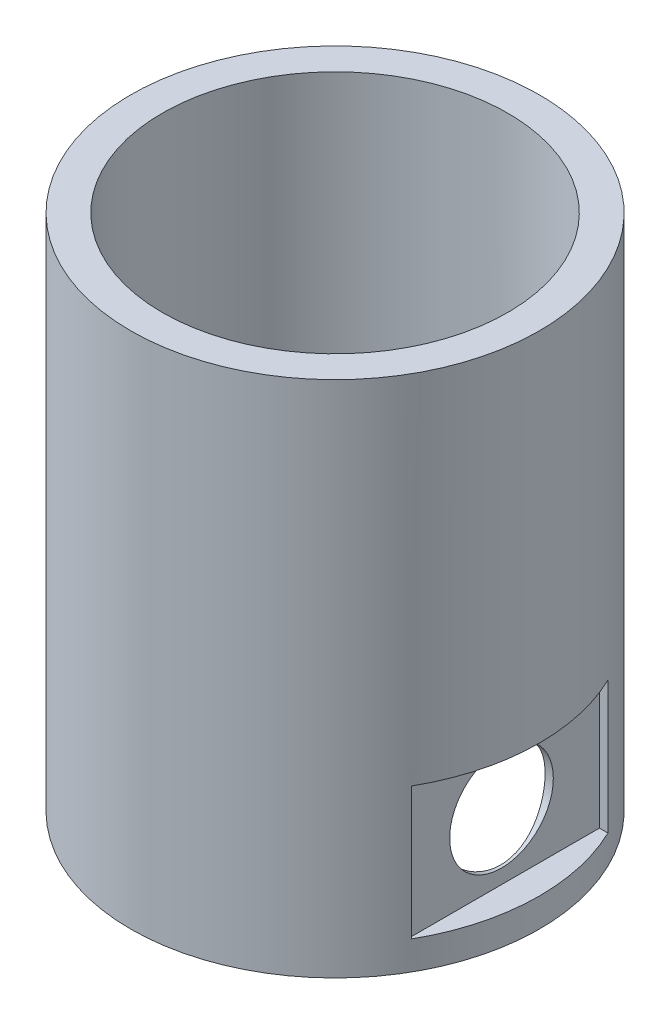
ISO-10303-21;
HEADER;
FILE_DESCRIPTION(('STEP AP214'),'2;1');
FILE_NAME('part.step','',(''),(''),'','','');
FILE_SCHEMA(('AUTOMOTIVE_DESIGN { 1 0 10303 214 1 1 1 1 }'));
ENDSEC;
DATA;
#1=APPLICATION_CONTEXT('core data for automotive mechanical design processes');
#2=APPLICATION_PROTOCOL_DEFINITION('international standard','automotive_design',2000,#1);
#3=PRODUCT_CONTEXT('',#1,'mechanical');
#4=PRODUCT('Part','Part','',(#3));
#5=PRODUCT_RELATED_PRODUCT_CATEGORY('part','',(#4));
#6=PRODUCT_DEFINITION_FORMATION('','',#4);
#7=PRODUCT_DEFINITION_CONTEXT('part definition',#1,'design');
#8=PRODUCT_DEFINITION('design','',#6,#7);
#9=PRODUCT_DEFINITION_SHAPE('','',#8);
#10=(LENGTH_UNIT() NAMED_UNIT(*) SI_UNIT(.MILLI.,.METRE.));
#11=(NAMED_UNIT(*) PLANE_ANGLE_UNIT() SI_UNIT($,.RADIAN.));
#12=(NAMED_UNIT(*) SI_UNIT($,.STERADIAN.) SOLID_ANGLE_UNIT());
#13=UNCERTAINTY_MEASURE_WITH_UNIT(LENGTH_MEASURE(1.E-05),#10,'distance_accuracy_value','');
#14=(GEOMETRIC_REPRESENTATION_CONTEXT(3) GLOBAL_UNCERTAINTY_ASSIGNED_CONTEXT((#13)) GLOBAL_UNIT_ASSIGNED_CONTEXT((#10,
#11,#12)) REPRESENTATION_CONTEXT('',''));
#15=CARTESIAN_POINT('',(0.,0.,0.));
#16=DIRECTION('',(0.,0.,1.));
#17=DIRECTION('',(1.,0.,0.));
#18=AXIS2_PLACEMENT_3D('',#15,#16,#17);
#19=CARTESIAN_POINT('',(0.,45.,-0.545038043279879));
#20=DIRECTION('',(0.,1.,0.));
#21=DIRECTION('',(0.,0.,1.));
#22=AXIS2_PLACEMENT_3D('',#19,#20,#21);
#23=PLANE('',#22);
#24=CARTESIAN_POINT('',(0.,45.,-0.545038043279879));
#25=DIRECTION('',(0.,1.,0.));
#26=DIRECTION('',(0.,0.,1.));
#27=AXIS2_PLACEMENT_3D('',#24,#25,#26);
#28=CIRCLE('',#27,17.75);
#29=CARTESIAN_POINT('',(0.,45.,17.2049619567201));
#30=VERTEX_POINT('',#29);
#31=EDGE_CURVE('E277',#30,#30,#28,.T.);
#32=ORIENTED_EDGE('',*,*,#31,.T.);
#33=EDGE_LOOP('',(#32));
#34=FACE_BOUND('',#33,.T.);
#35=CARTESIAN_POINT('',(0.,45.,-0.545038043279879));
#36=DIRECTION('',(0.,1.,0.));
#37=DIRECTION('',(0.,0.,1.));
#38=AXIS2_PLACEMENT_3D('',#35,#36,#37);
#39=CIRCLE('',#38,15.);
#40=CARTESIAN_POINT('',(0.,45.,14.4549619567201));
#41=VERTEX_POINT('',#40);
#42=EDGE_CURVE('E269',#41,#41,#39,.T.);
#43=ORIENTED_EDGE('',*,*,#42,.F.);
#44=EDGE_LOOP('',(#43));
#45=FACE_BOUND('',#44,.T.);
#46=ADVANCED_FACE('F41',(#34,#45),#23,.T.);
#47=CARTESIAN_POINT('',(0.,0.,-0.545038043279879));
#48=DIRECTION('',(0.,1.,0.));
#49=DIRECTION('',(0.,0.,1.));
#50=AXIS2_PLACEMENT_3D('',#47,#48,#49);
#51=PLANE('',#50);
#52=CARTESIAN_POINT('',(0.,0.,-0.545038043279879));
#53=DIRECTION('',(0.,1.,0.));
#54=DIRECTION('',(0.,0.,1.));
#55=AXIS2_PLACEMENT_3D('',#52,#53,#54);
#56=CIRCLE('',#55,17.75);
#57=CARTESIAN_POINT('',(0.,0.,17.2049619567201));
#58=VERTEX_POINT('',#57);
#59=EDGE_CURVE('E273',#58,#58,#56,.T.);
#60=ORIENTED_EDGE('',*,*,#59,.F.);
#61=EDGE_LOOP('',(#60));
#62=FACE_BOUND('',#61,.T.);
#63=CARTESIAN_POINT('',(0.,0.,-0.545038043279879));
#64=DIRECTION('',(0.,1.,0.));
#65=DIRECTION('',(0.,0.,1.));
#66=AXIS2_PLACEMENT_3D('',#63,#64,#65);
#67=CIRCLE('',#66,15.);
#68=CARTESIAN_POINT('',(0.,0.,14.4549619567201));
#69=VERTEX_POINT('',#68);
#70=EDGE_CURVE('E259',#69,#69,#67,.T.);
#71=ORIENTED_EDGE('',*,*,#70,.T.);
#72=EDGE_LOOP('',(#71));
#73=FACE_BOUND('',#72,.T.);
#74=ADVANCED_FACE('F204',(#62,#73),#51,.F.);
#75=CARTESIAN_POINT('',(0.,45.,-0.545038043279879));
#76=DIRECTION('',(0.,-1.,0.));
#77=DIRECTION('',(0.,0.,-1.));
#78=AXIS2_PLACEMENT_3D('',#75,#76,#77);
#79=CYLINDRICAL_SURFACE('',#78,17.75);
#80=CARTESIAN_POINT('',(0.,2.49310237707302,-0.545038043279879));
#81=DIRECTION('',(0.,-1.,0.));
#82=DIRECTION('',(0.,0.,-1.));
#83=AXIS2_PLACEMENT_3D('',#80,#81,#82);
#84=CIRCLE('',#83,17.75);
#85=CARTESIAN_POINT('',(-7.70496195672018,2.49310237707302,-16.5355371363506));
#86=VERTEX_POINT('',#85);
#87=CARTESIAN_POINT('',(8.79503804327983,2.49310237707302,-15.9628785476197));
#88=VERTEX_POINT('',#87);
#89=EDGE_CURVE('E297',#86,#88,#84,.T.);
#90=ORIENTED_EDGE('',*,*,#89,.T.);
#91=DIRECTION('',(0.,-1.,0.));
#92=VECTOR('',#91,1.);
#93=CARTESIAN_POINT('',(8.79503804327983,45.,-15.9628785476197));
#94=LINE('',#93,#92);
#95=CARTESIAN_POINT('',(8.79503804327983,13.993102377073,-15.9628785476197));
#96=VERTEX_POINT('',#95);
#97=EDGE_CURVE('E11',#88,#96,#94,.F.);
#98=ORIENTED_EDGE('',*,*,#97,.T.);
#99=CARTESIAN_POINT('',(0.,13.993102377073,-0.545038043279879));
#100=DIRECTION('',(0.,1.,0.));
#101=DIRECTION('',(0.,0.,1.));
#102=AXIS2_PLACEMENT_3D('',#99,#100,#101);
#103=CIRCLE('',#102,17.75);
#104=CARTESIAN_POINT('',(-7.70496195672018,13.993102377073,-16.5355371363506));
#105=VERTEX_POINT('',#104);
#106=EDGE_CURVE('E50',#96,#105,#103,.T.);
#107=ORIENTED_EDGE('',*,*,#106,.T.);
#108=DIRECTION('',(0.,-1.,0.));
#109=VECTOR('',#108,1.);
#110=CARTESIAN_POINT('',(-7.70496195672018,45.,-16.5355371363506));
#111=LINE('',#110,#109);
#112=EDGE_CURVE('E300',#105,#86,#111,.T.);
#113=ORIENTED_EDGE('',*,*,#112,.T.);
#114=EDGE_LOOP('',(#90,#98,#107,#113));
#115=FACE_BOUND('',#114,.T.);
#116=DIRECTION('',(0.,-1.,0.));
#117=VECTOR('',#116,1.);
#118=CARTESIAN_POINT('',(15.9904990930707,45.,-8.25));
#119=LINE('',#118,#117);
#120=CARTESIAN_POINT('',(15.9904990930707,13.993102377073,-8.25));
#121=VERTEX_POINT('',#120);
#122=CARTESIAN_POINT('',(15.9904990930707,2.49310237707302,-8.25));
#123=VERTEX_POINT('',#122);
#124=EDGE_CURVE('E293',#121,#123,#119,.T.);
#125=ORIENTED_EDGE('',*,*,#124,.T.);
#126=CARTESIAN_POINT('',(0.,2.49310237707302,-0.545038043279879));
#127=DIRECTION('',(0.,-1.,0.));
#128=DIRECTION('',(0.,0.,-1.));
#129=AXIS2_PLACEMENT_3D('',#126,#127,#128);
#130=CIRCLE('',#129,17.75);
#131=CARTESIAN_POINT('',(15.4178405043398,2.49310237707302,8.25));
#132=VERTEX_POINT('',#131);
#133=EDGE_CURVE('E280',#123,#132,#130,.T.);
#134=ORIENTED_EDGE('',*,*,#133,.T.);
#135=DIRECTION('',(0.,-1.,0.));
#136=VECTOR('',#135,1.);
#137=CARTESIAN_POINT('',(15.4178405043398,45.,8.25));
#138=LINE('',#137,#136);
#139=CARTESIAN_POINT('',(15.4178405043398,13.993102377073,8.25));
#140=VERTEX_POINT('',#139);
#141=EDGE_CURVE('E289',#132,#140,#138,.F.);
#142=ORIENTED_EDGE('',*,*,#141,.T.);
#143=CARTESIAN_POINT('',(0.,13.993102377073,-0.545038043279879));
#144=DIRECTION('',(0.,1.,0.));
#145=DIRECTION('',(0.,0.,1.));
#146=AXIS2_PLACEMENT_3D('',#143,#144,#145);
#147=CIRCLE('',#146,17.75);
#148=EDGE_CURVE('E65',#140,#121,#147,.T.);
#149=ORIENTED_EDGE('',*,*,#148,.T.);
#150=EDGE_LOOP('',(#125,#134,#142,#149));
#151=FACE_BOUND('',#150,.T.);
#152=ORIENTED_EDGE('',*,*,#31,.F.);
#153=EDGE_LOOP('',(#152));
#154=FACE_BOUND('',#153,.T.);
#155=ORIENTED_EDGE('',*,*,#59,.T.);
#156=EDGE_LOOP('',(#155));
#157=FACE_BOUND('',#156,.T.);
#158=ADVANCED_FACE('F43',(#115,#151,#154,#157),#79,.T.);
#159=CARTESIAN_POINT('',(0.,45.,-0.545038043279879));
#160=DIRECTION('',(0.,-1.,0.));
#161=DIRECTION('',(0.,0.,-1.));
#162=AXIS2_PLACEMENT_3D('',#159,#160,#161);
#163=CYLINDRICAL_SURFACE('',#162,15.);
#164=CARTESIAN_POINT('',(-3.70496195672017,8.24310237707302,-15.0802799366663));
#165=CARTESIAN_POINT('',(-3.7049587429981,8.49204109795378,-15.0802823942044));
#166=CARTESIAN_POINT('',(-3.68424025657052,8.74101195045807,-15.0856094309085));
#167=CARTESIAN_POINT('',(-3.60206513249844,9.23174987346723,-15.1061805870849));
#168=CARTESIAN_POINT('',(-3.54059589182706,9.47351469117524,-15.121427774545));
#169=CARTESIAN_POINT('',(-3.37901591384219,9.94274331237955,-15.1597252466156));
#170=CARTESIAN_POINT('',(-3.27895208231955,10.1702240872026,-15.1827660551125));
#171=CARTESIAN_POINT('',(-3.04311800711331,10.6052629955841,-15.2336024972076));
#172=CARTESIAN_POINT('',(-2.90734376616895,10.8128188952904,-15.261398662977));
#173=CARTESIAN_POINT('',(-2.60066875877768,11.2066635551969,-15.3187063321697));
#174=CARTESIAN_POINT('',(-2.42912226422998,11.3924464299549,-15.3482409730451));
#175=CARTESIAN_POINT('',(-2.05711204680241,11.7329188096785,-15.4045002282984));
#176=CARTESIAN_POINT('',(-1.85664704851551,11.8876069425368,-15.4312247186489));
#177=CARTESIAN_POINT('',(-1.43047663829931,12.1625204419467,-15.478221235381));
#178=CARTESIAN_POINT('',(-1.20459599746896,12.2824832579552,-15.498444226113));
#179=CARTESIAN_POINT('',(-0.735216694271336,12.4826033790142,-15.5288516176135));
#180=CARTESIAN_POINT('',(-0.491722184451395,12.5627700313715,-15.539038376242));
#181=CARTESIAN_POINT('',(-0.00187442808692508,12.6789110340154,-15.5469777281348));
#182=CARTESIAN_POINT('',(0.244178162152884,12.7161293823667,-15.5450912907816));
#183=CARTESIAN_POINT('',(0.738624022130161,12.7495641329282,-15.5288821387841));
#184=CARTESIAN_POINT('',(0.987016981418813,12.745785898891,-15.5145610512422));
#185=CARTESIAN_POINT('',(1.47382569339179,12.6981970112322,-15.4744159537256));
#186=CARTESIAN_POINT('',(1.71234162897986,12.6551980015419,-15.4488305815288));
#187=CARTESIAN_POINT('',(2.17824547432516,12.5320210077657,-15.3878979554775));
#188=CARTESIAN_POINT('',(2.40563197481963,12.4518383286999,-15.3525494691157));
#189=CARTESIAN_POINT('',(2.84924048100779,12.2544214535326,-15.2737137227353));
#190=CARTESIAN_POINT('',(3.06503555490272,12.1363027476605,-15.230043480066));
#191=CARTESIAN_POINT('',(3.47402581858523,11.8670520416533,-15.1387053290942));
#192=CARTESIAN_POINT('',(3.66721434217505,11.7159103412106,-15.0910362486971));
#193=CARTESIAN_POINT('',(4.03442560638507,11.3770258553029,-14.993605034853));
#194=CARTESIAN_POINT('',(4.20724010100253,11.18797108771,-14.943842570096));
#195=CARTESIAN_POINT('',(4.51884324643123,10.7825203449545,-14.849116114273));
#196=CARTESIAN_POINT('',(4.65762967664349,10.5661225868421,-14.8041524364738));
#197=CARTESIAN_POINT('',(4.89695993143332,10.1113259390639,-14.7237473619913));
#198=CARTESIAN_POINT('',(4.99749161701213,9.87292009556066,-14.6883089889243));
#199=CARTESIAN_POINT('',(5.15646854636879,9.38093521328626,-14.6311328875175));
#200=CARTESIAN_POINT('',(5.21493471485037,9.12736378643739,-14.609388348109));
#201=CARTESIAN_POINT('',(5.28531603164229,8.62730097722894,-14.5830851257999));
#202=CARTESIAN_POINT('',(5.29962322389103,8.38119171939172,-14.5776438275656));
#203=CARTESIAN_POINT('',(5.28788659752915,7.8901032972086,-14.5820712979737));
#204=CARTESIAN_POINT('',(5.2618497092844,7.64512394601589,-14.5919374370822));
#205=CARTESIAN_POINT('',(5.17206909938222,7.17179623981018,-14.6252313881493));
#206=CARTESIAN_POINT('',(5.10962375586303,6.94316564718512,-14.6481916561595));
#207=CARTESIAN_POINT('',(4.950281398073,6.49968641966399,-14.7049045864378));
#208=CARTESIAN_POINT('',(4.85337811649435,6.284840300324,-14.7386592119019));
#209=CARTESIAN_POINT('',(4.62387545054253,5.86633206126961,-14.8151074263997));
#210=CARTESIAN_POINT('',(4.49009697116618,5.66336935933276,-14.8580835135398));
#211=CARTESIAN_POINT('',(4.19222452677453,5.28207235639488,-14.9481429658924));
#212=CARTESIAN_POINT('',(4.02812100982617,5.10374584644176,-14.9952276227696));
#213=CARTESIAN_POINT('',(3.66367695769611,4.76663211589832,-15.0920265753213));
#214=CARTESIAN_POINT('',(3.46183971371919,4.60945917894452,-15.1417430579932));
#215=CARTESIAN_POINT('',(3.03370982084958,4.33112895022651,-15.2366896953608));
#216=CARTESIAN_POINT('',(2.80741615924603,4.20997315066841,-15.2819196641264));
#217=CARTESIAN_POINT('',(2.33555516926062,4.0071968526374,-15.364033096231));
#218=CARTESIAN_POINT('',(2.08993868458756,3.92568124067123,-15.4008942803139));
#219=CARTESIAN_POINT('',(1.58699181570852,3.80580828729977,-15.4629988636749));
#220=CARTESIAN_POINT('',(1.3296652826887,3.76743686190355,-15.4882460526353));
#221=CARTESIAN_POINT('',(0.82255854851521,3.73633418042306,-15.5245313850524));
#222=CARTESIAN_POINT('',(0.572935302682098,3.74169505640556,-15.5361384645488));
#223=CARTESIAN_POINT('',(0.0777677139657548,3.79366737753949,-15.5468798850004));
#224=CARTESIAN_POINT('',(-0.167777177608168,3.84027322715,-15.5460159176094));
#225=CARTESIAN_POINT('',(-0.6415983524994,3.9716783920018,-15.5331405437811));
#226=CARTESIAN_POINT('',(-0.870149899399836,4.05551729503909,-15.5214018550508));
#227=CARTESIAN_POINT('',(-1.31028375881877,4.25858514280775,-15.4893311274797));
#228=CARTESIAN_POINT('',(-1.52186424640741,4.3778178870423,-15.4689981659506));
#229=CARTESIAN_POINT('',(-1.92699223888309,4.65123020935595,-15.4221753774796));
#230=CARTESIAN_POINT('',(-2.1200584517679,4.8061013820337,-15.3955634000333));
#231=CARTESIAN_POINT('',(-2.47812139849073,5.14515972497322,-15.3400307643257));
#232=CARTESIAN_POINT('',(-2.64311101447038,5.3293543063405,-15.3111095233521));
#233=CARTESIAN_POINT('',(-2.94529543726975,5.72827403096127,-15.2538666827648));
#234=CARTESIAN_POINT('',(-3.0815145090154,5.94374589712693,-15.2255886932638));
#235=CARTESIAN_POINT('',(-3.31583725446314,6.39505046488967,-15.1744496988606));
#236=CARTESIAN_POINT('',(-3.41395466115904,6.63087579295448,-15.1515867433774));
#237=CARTESIAN_POINT('',(-3.5619769412922,7.09416123700282,-15.1161593999162));
#238=CARTESIAN_POINT('',(-3.61546014349508,7.32042573060282,-15.1028464631115));
#239=CARTESIAN_POINT('',(-3.68695169222632,7.77881883809647,-15.0849061872495));
#240=CARTESIAN_POINT('',(-3.70496495377917,8.01094663500405,-15.0802776448109));
#241=CARTESIAN_POINT('',(-3.70496195672017,8.24310237707302,-15.0802799366663));
#242=B_SPLINE_CURVE_WITH_KNOTS('',3,(#164,#165,#166,#167,#168,#169,#170,#171,#172,#173,#174,
#175,#176,#177,#178,#179,#180,#181,#182,#183,#184,#185,#186,#187,#188,#189,#190,#191,#192,#193,
#194,#195,#196,#197,#198,#199,#200,#201,#202,#203,#204,#205,#206,#207,#208,#209,#210,#211,#212,
#213,#214,#215,#216,#217,#218,#219,#220,#221,#222,#223,#224,#225,#226,#227,#228,#229,#230,#231,
#232,#233,#234,#235,#236,#237,#238,#239,#240,#241),.UNSPECIFIED.,.T.,.F.,(4,2,2,2,2,2,2,2,2,2,2,
2,2,2,2,2,2,2,2,2,2,2,2,2,2,2,2,2,2,2,2,2,2,2,2,2,2,2,4),(0.,0.745969128224237,1.49216907076764,
2.23746496520183,2.98284432019902,3.7430687174441,4.50332665349731,5.26919095506219,
6.03487528551584,6.77777604813014,7.52057961513485,8.2483517958854,8.97621589350551,
9.72246033358778,10.4689242739313,11.248045351272,12.0272172588699,12.8066362075912,
13.5856671803977,14.3216844448196,15.0575752891223,15.7687022681621,16.4799586552136,
17.2173073550445,17.9548887057978,18.7330405162276,19.5112245613431,20.2914565989046,
21.0714338634583,21.8175719228086,22.563608772102,23.2914285996166,24.0193265863335,
24.762761017875,25.5063836418491,26.2721846441147,27.0377093717517,27.7334830882668,
28.4291603855178),.UNSPECIFIED.);
#243=CARTESIAN_POINT('',(-3.70496195672017,8.24310237707302,-15.0802799366663));
#244=VERTEX_POINT('',#243);
#245=EDGE_CURVE('E138',#244,#244,#242,.T.);
#246=ORIENTED_EDGE('',*,*,#245,.T.);
#247=EDGE_LOOP('',(#246));
#248=FACE_BOUND('',#247,.T.);
#249=CARTESIAN_POINT('',(14.5352418933865,8.24310237707302,-4.25));
#250=CARTESIAN_POINT('',(14.5352443509245,8.49204109795378,-4.24999678627792));
#251=CARTESIAN_POINT('',(14.5405713876286,8.74101195045807,-4.22927829985035));
#252=CARTESIAN_POINT('',(14.561142543805,9.23174987346723,-4.14710317577827));
#253=CARTESIAN_POINT('',(14.5763897312652,9.47351469117524,-4.08563393510688));
#254=CARTESIAN_POINT('',(14.6146872033357,9.94274331237955,-3.92405395712202));
#255=CARTESIAN_POINT('',(14.6377280118327,10.1702240872026,-3.82399012559937));
#256=CARTESIAN_POINT('',(14.6885644539278,10.6052629955841,-3.58815605039314));
#257=CARTESIAN_POINT('',(14.7163606196972,10.8128188952904,-3.45238180944877));
#258=CARTESIAN_POINT('',(14.7736682888898,11.2066635551969,-3.1457068020575));
#259=CARTESIAN_POINT('',(14.8032029297652,11.3924464299549,-2.9741603075098));
#260=CARTESIAN_POINT('',(14.8594621850185,11.7329188096785,-2.60215009008224));
#261=CARTESIAN_POINT('',(14.886186675369,11.8876069425368,-2.40168509179534));
#262=CARTESIAN_POINT('',(14.9331831921011,12.1625204419467,-1.97551468157914));
#263=CARTESIAN_POINT('',(14.9534061828331,12.2824832579552,-1.74963404074878));
#264=CARTESIAN_POINT('',(14.9838135743336,12.4826033790142,-1.28025473755116));
#265=CARTESIAN_POINT('',(14.9940003329622,12.5627700313715,-1.03676022773122));
#266=CARTESIAN_POINT('',(15.0019396848549,12.6789110340154,-0.546912471366753));
#267=CARTESIAN_POINT('',(15.0000532475017,12.7161293823667,-0.300859881126944));
#268=CARTESIAN_POINT('',(14.9838440955042,12.7495641329282,0.193585978850333));
#269=CARTESIAN_POINT('',(14.9695230079623,12.745785898891,0.441978938138985));
#270=CARTESIAN_POINT('',(14.9293779104457,12.6981970112322,0.928787650111965));
#271=CARTESIAN_POINT('',(14.9037925382489,12.6551980015419,1.16730358570004));
#272=CARTESIAN_POINT('',(14.8428599121976,12.5320210077657,1.63320743104534));
#273=CARTESIAN_POINT('',(14.8075114258358,12.4518383286999,1.8605939315398));
#274=CARTESIAN_POINT('',(14.7286756794555,12.2544214535326,2.30420243772796));
#275=CARTESIAN_POINT('',(14.6850054367861,12.1363027476605,2.51999751162289));
#276=CARTESIAN_POINT('',(14.5936672858143,11.8670520416533,2.9289877753054));
#277=CARTESIAN_POINT('',(14.5459982054172,11.7159103412106,3.12217629889522));
#278=CARTESIAN_POINT('',(14.4485669915731,11.3770258553029,3.48938756310524));
#279=CARTESIAN_POINT('',(14.3988045268161,11.18797108771,3.6622020577227));
#280=CARTESIAN_POINT('',(14.3040780709931,10.7825203449545,3.9738052031514));
#281=CARTESIAN_POINT('',(14.2591143931939,10.5661225868421,4.11259163336366));
#282=CARTESIAN_POINT('',(14.1787093187114,10.1113259390639,4.35192188815349));
#283=CARTESIAN_POINT('',(14.1432709456444,9.87292009556066,4.4524535737323));
#284=CARTESIAN_POINT('',(14.0860948442376,9.38093521328626,4.61143050308896));
#285=CARTESIAN_POINT('',(14.0643503048291,9.12736378643739,4.66989667157054));
#286=CARTESIAN_POINT('',(14.03804708252,8.62730097722894,4.74027798836246));
#287=CARTESIAN_POINT('',(14.0326057842857,8.38119171939172,4.7545851806112));
#288=CARTESIAN_POINT('',(14.0370332546938,7.8901032972086,4.74284855424932));
#289=CARTESIAN_POINT('',(14.0468993938023,7.64512394601589,4.71681166600457));
#290=CARTESIAN_POINT('',(14.0801933448694,7.17179623981018,4.62703105610239));
#291=CARTESIAN_POINT('',(14.1031536128796,6.94316564718512,4.5645857125832));
#292=CARTESIAN_POINT('',(14.1598665431579,6.49968641966399,4.40524335479317));
#293=CARTESIAN_POINT('',(14.193621168622,6.284840300324,4.30834007321452));
#294=CARTESIAN_POINT('',(14.2700693831198,5.86633206126961,4.0788374072627));
#295=CARTESIAN_POINT('',(14.3130454702599,5.66336935933276,3.94505892788635));
#296=CARTESIAN_POINT('',(14.4031049226126,5.28207235639488,3.64718648349471));
#297=CARTESIAN_POINT('',(14.4501895794897,5.10374584644176,3.48308296654634));
#298=CARTESIAN_POINT('',(14.5469885320414,4.76663211589832,3.11863891441628));
#299=CARTESIAN_POINT('',(14.5967050147133,4.60945917894452,2.91680167043937));
#300=CARTESIAN_POINT('',(14.6916516520809,4.33112895022651,2.48867177756975));
#301=CARTESIAN_POINT('',(14.7368816208466,4.20997315066841,2.2623781159662));
#302=CARTESIAN_POINT('',(14.8189950529511,4.0071968526374,1.7905171259808));
#303=CARTESIAN_POINT('',(14.855856237034,3.92568124067123,1.54490064130773));
#304=CARTESIAN_POINT('',(14.9179608203951,3.80580828729977,1.0419537724287));
#305=CARTESIAN_POINT('',(14.9432080093554,3.76743686190355,0.784627239408869));
#306=CARTESIAN_POINT('',(14.9794933417725,3.73633418042306,0.277520505235383));
#307=CARTESIAN_POINT('',(14.9911004212689,3.74169505640556,0.0278972594022706));
#308=CARTESIAN_POINT('',(15.0018418417205,3.7936673775395,-0.467270329314073));
#309=CARTESIAN_POINT('',(15.0009778743295,3.84027322715,-0.712815220887995));
#310=CARTESIAN_POINT('',(14.9881025005012,3.9716783920018,-1.18663639577923));
#311=CARTESIAN_POINT('',(14.9763638117709,4.05551729503909,-1.41518794267966));
#312=CARTESIAN_POINT('',(14.9442930841998,4.25858514280776,-1.8553218020986));
#313=CARTESIAN_POINT('',(14.9239601226707,4.3778178870423,-2.06690228968724));
#314=CARTESIAN_POINT('',(14.8771373341998,4.65123020935595,-2.47203028216291));
#315=CARTESIAN_POINT('',(14.8505253567534,4.8061013820337,-2.66509649504772));
#316=CARTESIAN_POINT('',(14.7949927210458,5.14515972497322,-3.02315944177056));
#317=CARTESIAN_POINT('',(14.7660714800722,5.3293543063405,-3.1881490577502));
#318=CARTESIAN_POINT('',(14.7088286394849,5.72827403096127,-3.49033348054957));
#319=CARTESIAN_POINT('',(14.6805506499839,5.94374589712693,-3.62655255229523));
#320=CARTESIAN_POINT('',(14.6294116555807,6.39505046488967,-3.86087529774297));
#321=CARTESIAN_POINT('',(14.6065487000975,6.63087579295448,-3.95899270443887));
#322=CARTESIAN_POINT('',(14.5711213566363,7.09416123700281,-4.10701498457203));
#323=CARTESIAN_POINT('',(14.5578084198316,7.32042573060282,-4.16049818677491));
#324=CARTESIAN_POINT('',(14.5398681439696,7.77881883809646,-4.23198973550615));
#325=CARTESIAN_POINT('',(14.535239601531,8.01094663500404,-4.250002997059));
#326=CARTESIAN_POINT('',(14.5352418933865,8.24310237707302,-4.25));
#327=B_SPLINE_CURVE_WITH_KNOTS('',3,(#249,#250,#251,#252,#253,#254,#255,#256,#257,#258,#259,
#260,#261,#262,#263,#264,#265,#266,#267,#268,#269,#270,#271,#272,#273,#274,#275,#276,#277,#278,
#279,#280,#281,#282,#283,#284,#285,#286,#287,#288,#289,#290,#291,#292,#293,#294,#295,#296,#297,
#298,#299,#300,#301,#302,#303,#304,#305,#306,#307,#308,#309,#310,#311,#312,#313,#314,#315,#316,
#317,#318,#319,#320,#321,#322,#323,#324,#325,#326),.UNSPECIFIED.,.T.,.F.,(4,2,2,2,2,2,2,2,2,2,2,
2,2,2,2,2,2,2,2,2,2,2,2,2,2,2,2,2,2,2,2,2,2,2,2,2,2,2,4),(0.,0.745969128224237,1.49216907076764,
2.23746496520183,2.98284432019902,3.7430687174441,4.50332665349731,5.26919095506219,
6.03487528551584,6.77777604813013,7.52057961513484,8.2483517958854,8.97621589350551,
9.72246033358778,10.4689242739313,11.248045351272,12.0272172588699,12.8066362075912,
13.5856671803977,14.3216844448196,15.0575752891223,15.7687022681621,16.4799586552135,
17.2173073550445,17.9548887057978,18.7330405162275,19.5112245613431,20.2914565989046,
21.0714338634583,21.8175719228086,22.563608772102,23.2914285996166,24.0193265863335,
24.762761017875,25.5063836418491,26.2721846441147,27.0377093717517,27.7334830882668,
28.4291603855178),.UNSPECIFIED.);
#328=CARTESIAN_POINT('',(14.5352418933865,8.24310237707302,-4.25));
#329=VERTEX_POINT('',#328);
#330=EDGE_CURVE('E154',#329,#329,#327,.T.);
#331=ORIENTED_EDGE('',*,*,#330,.T.);
#332=EDGE_LOOP('',(#331));
#333=FACE_BOUND('',#332,.T.);
#334=ORIENTED_EDGE('',*,*,#42,.T.);
#335=EDGE_LOOP('',(#334));
#336=FACE_BOUND('',#335,.T.);
#337=ORIENTED_EDGE('',*,*,#70,.F.);
#338=EDGE_LOOP('',(#337));
#339=FACE_BOUND('',#338,.T.);
#340=ADVANCED_FACE('F214',(#248,#333,#336,#339),#163,.F.);
#341=CARTESIAN_POINT('',(15.25,13.993102377073,8.25));
#342=DIRECTION('',(0.,0.,1.));
#343=DIRECTION('',(1.,0.,0.));
#344=AXIS2_PLACEMENT_3D('',#341,#342,#343);
#345=PLANE('',#344);
#346=DIRECTION('',(1.,0.,0.));
#347=VECTOR('',#346,1.);
#348=CARTESIAN_POINT('',(15.25,2.49310237707302,8.25));
#349=LINE('',#348,#347);
#350=CARTESIAN_POINT('',(15.25,2.49310237707302,8.25));
#351=VERTEX_POINT('',#350);
#352=EDGE_CURVE('E57',#351,#132,#349,.T.);
#353=ORIENTED_EDGE('',*,*,#352,.F.);
#354=DIRECTION('',(0.,-1.,0.));
#355=VECTOR('',#354,1.);
#356=CARTESIAN_POINT('',(15.25,13.993102377073,8.25));
#357=LINE('',#356,#355);
#358=CARTESIAN_POINT('',(15.25,13.993102377073,8.25));
#359=VERTEX_POINT('',#358);
#360=EDGE_CURVE('E165',#359,#351,#357,.T.);
#361=ORIENTED_EDGE('',*,*,#360,.F.);
#362=DIRECTION('',(1.,0.,0.));
#363=VECTOR('',#362,1.);
#364=CARTESIAN_POINT('',(15.25,13.993102377073,8.25));
#365=LINE('',#364,#363);
#366=EDGE_CURVE('E256',#359,#140,#365,.T.);
#367=ORIENTED_EDGE('',*,*,#366,.T.);
#368=ORIENTED_EDGE('',*,*,#141,.F.);
#369=EDGE_LOOP('',(#353,#361,#367,#368));
#370=FACE_BOUND('',#369,.T.);
#371=ADVANCED_FACE('F217',(#370),#345,.F.);
#372=CARTESIAN_POINT('',(15.25,13.993102377073,8.25));
#373=DIRECTION('',(0.,1.,0.));
#374=DIRECTION('',(0.,0.,1.));
#375=AXIS2_PLACEMENT_3D('',#372,#373,#374);
#376=PLANE('',#375);
#377=ORIENTED_EDGE('',*,*,#366,.F.);
#378=DIRECTION('',(0.,0.,1.));
#379=VECTOR('',#378,1.);
#380=CARTESIAN_POINT('',(15.25,13.993102377073,8.25));
#381=LINE('',#380,#379);
#382=CARTESIAN_POINT('',(15.25,13.993102377073,-8.25));
#383=VERTEX_POINT('',#382);
#384=EDGE_CURVE('E247',#383,#359,#381,.T.);
#385=ORIENTED_EDGE('',*,*,#384,.F.);
#386=DIRECTION('',(1.,0.,0.));
#387=VECTOR('',#386,1.);
#388=CARTESIAN_POINT('',(15.25,13.993102377073,-8.25));
#389=LINE('',#388,#387);
#390=EDGE_CURVE('E260',#383,#121,#389,.T.);
#391=ORIENTED_EDGE('',*,*,#390,.T.);
#392=ORIENTED_EDGE('',*,*,#148,.F.);
#393=EDGE_LOOP('',(#377,#385,#391,#392));
#394=FACE_BOUND('',#393,.T.);
#395=ADVANCED_FACE('F221',(#394),#376,.F.);
#396=CARTESIAN_POINT('',(15.25,13.993102377073,-8.25));
#397=DIRECTION('',(0.,0.,-1.));
#398=DIRECTION('',(-1.,0.,0.));
#399=AXIS2_PLACEMENT_3D('',#396,#397,#398);
#400=PLANE('',#399);
#401=ORIENTED_EDGE('',*,*,#390,.F.);
#402=DIRECTION('',(0.,1.,0.));
#403=VECTOR('',#402,1.);
#404=CARTESIAN_POINT('',(15.25,13.993102377073,-8.25));
#405=LINE('',#404,#403);
#406=CARTESIAN_POINT('',(15.25,2.49310237707302,-8.25));
#407=VERTEX_POINT('',#406);
#408=EDGE_CURVE('E250',#407,#383,#405,.T.);
#409=ORIENTED_EDGE('',*,*,#408,.F.);
#410=DIRECTION('',(1.,0.,0.));
#411=VECTOR('',#410,1.);
#412=CARTESIAN_POINT('',(15.25,2.49310237707302,-8.25));
#413=LINE('',#412,#411);
#414=EDGE_CURVE('E263',#407,#123,#413,.T.);
#415=ORIENTED_EDGE('',*,*,#414,.T.);
#416=ORIENTED_EDGE('',*,*,#124,.F.);
#417=EDGE_LOOP('',(#401,#409,#415,#416));
#418=FACE_BOUND('',#417,.T.);
#419=ADVANCED_FACE('F227',(#418),#400,.F.);
#420=CARTESIAN_POINT('',(15.25,2.49310237707302,8.25));
#421=DIRECTION('',(0.,-1.,0.));
#422=DIRECTION('',(0.,0.,-1.));
#423=AXIS2_PLACEMENT_3D('',#420,#421,#422);
#424=PLANE('',#423);
#425=ORIENTED_EDGE('',*,*,#414,.F.);
#426=DIRECTION('',(0.,0.,-1.));
#427=VECTOR('',#426,1.);
#428=CARTESIAN_POINT('',(15.25,2.49310237707302,8.25));
#429=LINE('',#428,#427);
#430=EDGE_CURVE('E245',#351,#407,#429,.T.);
#431=ORIENTED_EDGE('',*,*,#430,.F.);
#432=ORIENTED_EDGE('',*,*,#352,.T.);
#433=ORIENTED_EDGE('',*,*,#133,.F.);
#434=EDGE_LOOP('',(#425,#431,#432,#433));
#435=FACE_BOUND('',#434,.T.);
#436=ADVANCED_FACE('F223',(#435),#424,.F.);
#437=CARTESIAN_POINT('',(15.25,0.,0.));
#438=DIRECTION('',(1.,0.,0.));
#439=DIRECTION('',(0.,0.,-1.));
#440=AXIS2_PLACEMENT_3D('',#437,#438,#439);
#441=PLANE('',#440);
#442=CARTESIAN_POINT('',(15.25,8.24310237707302,0.25));
#443=DIRECTION('',(1.,0.,0.));
#444=DIRECTION('',(0.,0.,-1.));
#445=AXIS2_PLACEMENT_3D('',#442,#443,#444);
#446=CIRCLE('',#445,4.5);
#447=CARTESIAN_POINT('',(15.25,8.24310237707302,-4.25));
#448=VERTEX_POINT('',#447);
#449=EDGE_CURVE('E161',#448,#448,#446,.T.);
#450=ORIENTED_EDGE('',*,*,#449,.F.);
#451=EDGE_LOOP('',(#450));
#452=FACE_BOUND('',#451,.T.);
#453=ORIENTED_EDGE('',*,*,#360,.T.);
#454=ORIENTED_EDGE('',*,*,#430,.T.);
#455=ORIENTED_EDGE('',*,*,#408,.T.);
#456=ORIENTED_EDGE('',*,*,#384,.T.);
#457=EDGE_LOOP('',(#453,#454,#455,#456));
#458=FACE_BOUND('',#457,.T.);
#459=ADVANCED_FACE('F226',(#452,#458),#441,.T.);
#460=CARTESIAN_POINT('',(-17.751,8.24310237707302,0.25));
#461=DIRECTION('',(1.,0.,0.));
#462=DIRECTION('',(0.,0.,-1.));
#463=AXIS2_PLACEMENT_3D('',#460,#461,#462);
#464=CYLINDRICAL_SURFACE('',#463,4.5);
#465=ORIENTED_EDGE('',*,*,#330,.F.);
#466=EDGE_LOOP('',(#465));
#467=FACE_BOUND('',#466,.T.);
#468=ORIENTED_EDGE('',*,*,#449,.T.);
#469=EDGE_LOOP('',(#468));
#470=FACE_BOUND('',#469,.T.);
#471=ADVANCED_FACE('F175',(#467,#470),#464,.F.);
#472=CARTESIAN_POINT('',(8.79503804327983,13.993102377073,-15.7950380432799));
#473=DIRECTION('',(1.,0.,0.));
#474=DIRECTION('',(0.,0.,-1.));
#475=AXIS2_PLACEMENT_3D('',#472,#473,#474);
#476=PLANE('',#475);
#477=DIRECTION('',(0.,0.,-1.));
#478=VECTOR('',#477,1.);
#479=CARTESIAN_POINT('',(8.79503804327983,2.49310237707302,-15.7950380432799));
#480=LINE('',#479,#478);
#481=CARTESIAN_POINT('',(8.79503804327983,2.49310237707302,-15.7950380432799));
#482=VERTEX_POINT('',#481);
#483=EDGE_CURVE('E109',#482,#88,#480,.T.);
#484=ORIENTED_EDGE('',*,*,#483,.F.);
#485=DIRECTION('',(0.,-1.,0.));
#486=VECTOR('',#485,1.);
#487=CARTESIAN_POINT('',(8.79503804327983,13.993102377073,-15.7950380432799));
#488=LINE('',#487,#486);
#489=CARTESIAN_POINT('',(8.79503804327983,13.993102377073,-15.7950380432799));
#490=VERTEX_POINT('',#489);
#491=EDGE_CURVE('E114',#490,#482,#488,.T.);
#492=ORIENTED_EDGE('',*,*,#491,.F.);
#493=DIRECTION('',(0.,0.,-1.));
#494=VECTOR('',#493,1.);
#495=CARTESIAN_POINT('',(8.79503804327983,13.993102377073,-15.7950380432799));
#496=LINE('',#495,#494);
#497=EDGE_CURVE('E151',#490,#96,#496,.T.);
#498=ORIENTED_EDGE('',*,*,#497,.T.);
#499=ORIENTED_EDGE('',*,*,#97,.F.);
#500=EDGE_LOOP('',(#484,#492,#498,#499));
#501=FACE_BOUND('',#500,.T.);
#502=ADVANCED_FACE('F111',(#501),#476,.F.);
#503=CARTESIAN_POINT('',(8.79503804327983,13.993102377073,-15.7950380432799));
#504=DIRECTION('',(0.,1.,0.));
#505=DIRECTION('',(0.,0.,1.));
#506=AXIS2_PLACEMENT_3D('',#503,#504,#505);
#507=PLANE('',#506);
#508=ORIENTED_EDGE('',*,*,#497,.F.);
#509=DIRECTION('',(1.,0.,0.));
#510=VECTOR('',#509,1.);
#511=CARTESIAN_POINT('',(8.79503804327983,13.993102377073,-15.7950380432799));
#512=LINE('',#511,#510);
#513=CARTESIAN_POINT('',(-7.70496195672018,13.993102377073,-15.7950380432799));
#514=VERTEX_POINT('',#513);
#515=EDGE_CURVE('E119',#514,#490,#512,.T.);
#516=ORIENTED_EDGE('',*,*,#515,.F.);
#517=DIRECTION('',(0.,0.,-1.));
#518=VECTOR('',#517,1.);
#519=CARTESIAN_POINT('',(-7.70496195672018,13.993102377073,-15.7950380432799));
#520=LINE('',#519,#518);
#521=EDGE_CURVE('E155',#514,#105,#520,.T.);
#522=ORIENTED_EDGE('',*,*,#521,.T.);
#523=ORIENTED_EDGE('',*,*,#106,.F.);
#524=EDGE_LOOP('',(#508,#516,#522,#523));
#525=FACE_BOUND('',#524,.T.);
#526=ADVANCED_FACE('F182',(#525),#507,.F.);
#527=CARTESIAN_POINT('',(-7.70496195672018,13.993102377073,-15.7950380432799));
#528=DIRECTION('',(-1.,0.,0.));
#529=DIRECTION('',(0.,0.,1.));
#530=AXIS2_PLACEMENT_3D('',#527,#528,#529);
#531=PLANE('',#530);
#532=ORIENTED_EDGE('',*,*,#521,.F.);
#533=DIRECTION('',(0.,1.,0.));
#534=VECTOR('',#533,1.);
#535=CARTESIAN_POINT('',(-7.70496195672018,13.993102377073,-15.7950380432799));
#536=LINE('',#535,#534);
#537=CARTESIAN_POINT('',(-7.70496195672018,2.49310237707302,-15.7950380432799));
#538=VERTEX_POINT('',#537);
#539=EDGE_CURVE('E129',#538,#514,#536,.T.);
#540=ORIENTED_EDGE('',*,*,#539,.F.);
#541=DIRECTION('',(0.,0.,-1.));
#542=VECTOR('',#541,1.);
#543=CARTESIAN_POINT('',(-7.70496195672018,2.49310237707302,-15.7950380432799));
#544=LINE('',#543,#542);
#545=EDGE_CURVE('E118',#538,#86,#544,.T.);
#546=ORIENTED_EDGE('',*,*,#545,.T.);
#547=ORIENTED_EDGE('',*,*,#112,.F.);
#548=EDGE_LOOP('',(#532,#540,#546,#547));
#549=FACE_BOUND('',#548,.T.);
#550=ADVANCED_FACE('F185',(#549),#531,.F.);
#551=CARTESIAN_POINT('',(8.79503804327983,2.49310237707302,-15.7950380432799));
#552=DIRECTION('',(0.,-1.,0.));
#553=DIRECTION('',(0.,0.,-1.));
#554=AXIS2_PLACEMENT_3D('',#551,#552,#553);
#555=PLANE('',#554);
#556=ORIENTED_EDGE('',*,*,#89,.F.);
#557=ORIENTED_EDGE('',*,*,#545,.F.);
#558=DIRECTION('',(-1.,0.,0.));
#559=VECTOR('',#558,1.);
#560=CARTESIAN_POINT('',(8.79503804327983,2.49310237707302,-15.7950380432799));
#561=LINE('',#560,#559);
#562=EDGE_CURVE('E122',#482,#538,#561,.T.);
#563=ORIENTED_EDGE('',*,*,#562,.F.);
#564=ORIENTED_EDGE('',*,*,#483,.T.);
#565=EDGE_LOOP('',(#556,#557,#563,#564));
#566=FACE_BOUND('',#565,.T.);
#567=ADVANCED_FACE('F123',(#566),#555,.F.);
#568=CARTESIAN_POINT('',(0.545038043279826,0.,-15.7950380432799));
#569=DIRECTION('',(0.,0.,-1.));
#570=DIRECTION('',(-1.,0.,0.));
#571=AXIS2_PLACEMENT_3D('',#568,#569,#570);
#572=PLANE('',#571);
#573=CARTESIAN_POINT('',(0.795038043279826,8.24310237707302,-15.7950380432799));
#574=DIRECTION('',(0.,0.,-1.));
#575=DIRECTION('',(-1.,0.,0.));
#576=AXIS2_PLACEMENT_3D('',#573,#574,#575);
#577=CIRCLE('',#576,4.5);
#578=CARTESIAN_POINT('',(-3.70496195672017,8.24310237707302,-15.7950380432799));
#579=VERTEX_POINT('',#578);
#580=EDGE_CURVE('E134',#579,#579,#577,.T.);
#581=ORIENTED_EDGE('',*,*,#580,.F.);
#582=EDGE_LOOP('',(#581));
#583=FACE_BOUND('',#582,.T.);
#584=ORIENTED_EDGE('',*,*,#491,.T.);
#585=ORIENTED_EDGE('',*,*,#562,.T.);
#586=ORIENTED_EDGE('',*,*,#539,.T.);
#587=ORIENTED_EDGE('',*,*,#515,.T.);
#588=EDGE_LOOP('',(#584,#585,#586,#587));
#589=FACE_BOUND('',#588,.T.);
#590=ADVANCED_FACE('F131',(#583,#589),#572,.T.);
#591=CARTESIAN_POINT('',(0.795038043279941,8.24310237707302,17.2059619567202));
#592=DIRECTION('',(0.,0.,-1.));
#593=DIRECTION('',(-1.,0.,0.));
#594=AXIS2_PLACEMENT_3D('',#591,#592,#593);
#595=CYLINDRICAL_SURFACE('',#594,4.5);
#596=ORIENTED_EDGE('',*,*,#245,.F.);
#597=EDGE_LOOP('',(#596));
#598=FACE_BOUND('',#597,.T.);
#599=ORIENTED_EDGE('',*,*,#580,.T.);
#600=EDGE_LOOP('',(#599));
#601=FACE_BOUND('',#600,.T.);
#602=ADVANCED_FACE('F193',(#598,#601),#595,.F.);
#603=CLOSED_SHELL('',(#46,#74,#158,#340,#371,#395,#419,#436,#459,#471,#502,#526,#550,#567,#590,#602));
#604=MANIFOLD_SOLID_BREP('B2',#603);
#605=ADVANCED_BREP_SHAPE_REPRESENTATION('',(#18,#604),#14);
#606=SHAPE_DEFINITION_REPRESENTATION(#9,#605);
ENDSEC;
END-ISO-10303-21;
